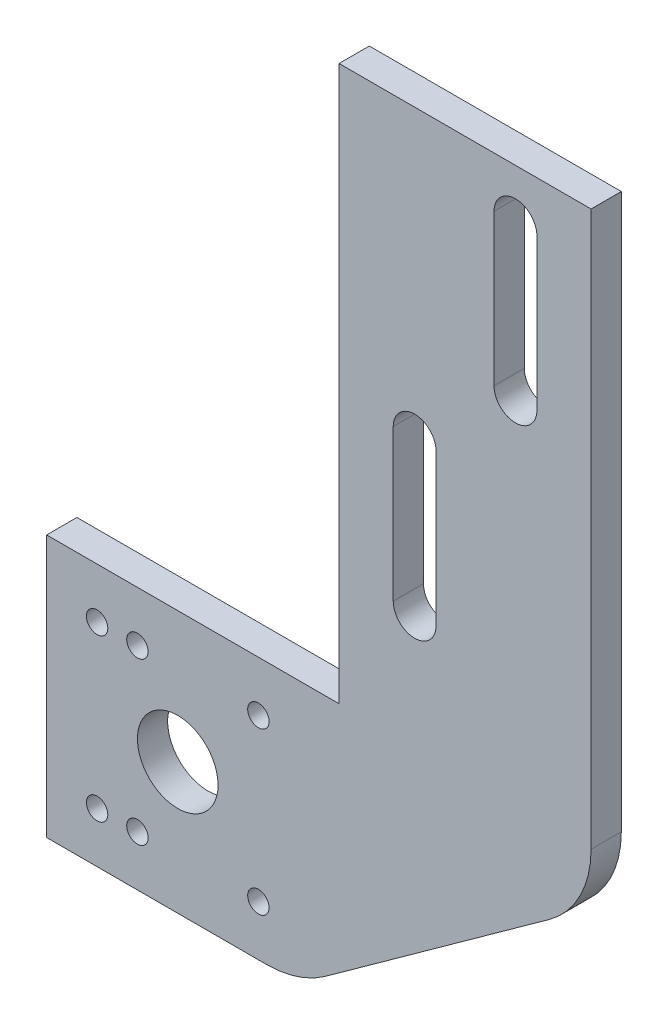
ISO-10303-21;
HEADER;
FILE_DESCRIPTION(('STEP AP214'),'2;1');
FILE_NAME('part.step','',(''),(''),'','','');
FILE_SCHEMA(('AUTOMOTIVE_DESIGN { 1 0 10303 214 1 1 1 1 }'));
ENDSEC;
DATA;
#1=APPLICATION_CONTEXT('core data for automotive mechanical design processes');
#2=APPLICATION_PROTOCOL_DEFINITION('international standard','automotive_design',2000,#1);
#3=PRODUCT_CONTEXT('',#1,'mechanical');
#4=PRODUCT('Part','Part','',(#3));
#5=PRODUCT_RELATED_PRODUCT_CATEGORY('part','',(#4));
#6=PRODUCT_DEFINITION_FORMATION('','',#4);
#7=PRODUCT_DEFINITION_CONTEXT('part definition',#1,'design');
#8=PRODUCT_DEFINITION('design','',#6,#7);
#9=PRODUCT_DEFINITION_SHAPE('','',#8);
#10=(LENGTH_UNIT() NAMED_UNIT(*) SI_UNIT(.MILLI.,.METRE.));
#11=(NAMED_UNIT(*) PLANE_ANGLE_UNIT() SI_UNIT($,.RADIAN.));
#12=(NAMED_UNIT(*) SI_UNIT($,.STERADIAN.) SOLID_ANGLE_UNIT());
#13=UNCERTAINTY_MEASURE_WITH_UNIT(LENGTH_MEASURE(1.E-05),#10,'distance_accuracy_value','');
#14=(GEOMETRIC_REPRESENTATION_CONTEXT(3) GLOBAL_UNCERTAINTY_ASSIGNED_CONTEXT((#13)) GLOBAL_UNIT_ASSIGNED_CONTEXT((#10,
#11,#12)) REPRESENTATION_CONTEXT('',''));
#15=CARTESIAN_POINT('',(0.,0.,0.));
#16=DIRECTION('',(0.,0.,1.));
#17=DIRECTION('',(1.,0.,0.));
#18=AXIS2_PLACEMENT_3D('',#15,#16,#17);
#19=CARTESIAN_POINT('',(65.6099737277178,39.5652331269895,6.));
#20=DIRECTION('',(0.,0.,-1.));
#21=DIRECTION('',(-1.,0.,0.));
#22=AXIS2_PLACEMENT_3D('',#19,#20,#21);
#23=PLANE('',#22);
#24=CARTESIAN_POINT('',(50.6099737277178,92.5652331269895,6.));
#25=DIRECTION('',(0.,0.,1.));
#26=DIRECTION('',(1.,0.,0.));
#27=AXIS2_PLACEMENT_3D('',#24,#25,#26);
#28=CIRCLE('',#27,4.24999999999999);
#29=CARTESIAN_POINT('',(54.8599737277178,92.5652331269895,6.));
#30=VERTEX_POINT('',#29);
#31=CARTESIAN_POINT('',(46.3599737277178,92.5652331269895,6.));
#32=VERTEX_POINT('',#31);
#33=EDGE_CURVE('E213',#30,#32,#28,.T.);
#34=ORIENTED_EDGE('',*,*,#33,.F.);
#35=DIRECTION('',(0.,1.,0.));
#36=VECTOR('',#35,1.);
#37=CARTESIAN_POINT('',(54.8599737277178,92.5652331269895,6.));
#38=LINE('',#37,#36);
#39=CARTESIAN_POINT('',(54.8599737277178,62.5652331269895,6.));
#40=VERTEX_POINT('',#39);
#41=EDGE_CURVE('E224',#40,#30,#38,.T.);
#42=ORIENTED_EDGE('',*,*,#41,.F.);
#43=CARTESIAN_POINT('',(50.6099737277178,62.5652331269895,6.));
#44=DIRECTION('',(0.,0.,1.));
#45=DIRECTION('',(1.,0.,0.));
#46=AXIS2_PLACEMENT_3D('',#43,#44,#45);
#47=CIRCLE('',#46,4.25);
#48=CARTESIAN_POINT('',(46.3599737277178,62.5652331269895,6.));
#49=VERTEX_POINT('',#48);
#50=EDGE_CURVE('E220',#49,#40,#47,.T.);
#51=ORIENTED_EDGE('',*,*,#50,.F.);
#52=DIRECTION('',(0.,-1.,0.));
#53=VECTOR('',#52,1.);
#54=CARTESIAN_POINT('',(46.3599737277178,92.5652331269895,6.));
#55=LINE('',#54,#53);
#56=EDGE_CURVE('E216',#32,#49,#55,.T.);
#57=ORIENTED_EDGE('',*,*,#56,.F.);
#58=EDGE_LOOP('',(#34,#42,#51,#57));
#59=FACE_BOUND('',#58,.T.);
#60=DIRECTION('',(0.,-1.,0.));
#61=VECTOR('',#60,1.);
#62=CARTESIAN_POINT('',(-22.3900262722822,-12.4347668730105,6.));
#63=LINE('',#62,#61);
#64=CARTESIAN_POINT('',(-22.3900262722822,39.5652331269895,6.));
#65=VERTEX_POINT('',#64);
#66=CARTESIAN_POINT('',(-22.3900262722822,-12.4347668730105,6.));
#67=VERTEX_POINT('',#66);
#68=EDGE_CURVE('E312',#65,#67,#63,.T.);
#69=ORIENTED_EDGE('',*,*,#68,.T.);
#70=DIRECTION('',(1.,0.,0.));
#71=VECTOR('',#70,1.);
#72=CARTESIAN_POINT('',(-22.3900262722822,-12.4347668730105,6.));
#73=LINE('',#72,#71);
#74=CARTESIAN_POINT('',(21.1597205443689,-12.4347668730105,6.));
#75=VERTEX_POINT('',#74);
#76=EDGE_CURVE('E316',#67,#75,#73,.T.);
#77=ORIENTED_EDGE('',*,*,#76,.T.);
#78=CARTESIAN_POINT('',(21.1597205443689,7.56523312698948,6.));
#79=DIRECTION('',(0.,0.,1.));
#80=DIRECTION('',(1.,0.,0.));
#81=AXIS2_PLACEMENT_3D('',#78,#79,#80);
#82=CIRCLE('',#81,20.);
#83=CARTESIAN_POINT('',(32.844809242165,-8.66617784447688,6.));
#84=VERTEX_POINT('',#83);
#85=EDGE_CURVE('E320',#75,#84,#82,.T.);
#86=ORIENTED_EDGE('',*,*,#85,.T.);
#87=DIRECTION('',(0.811570548573318,0.584254434889803,0.));
#88=VECTOR('',#87,1.);
#89=CARTESIAN_POINT('',(32.844809242165,-8.66617784447688,6.));
#90=LINE('',#89,#88);
#91=CARTESIAN_POINT('',(77.2950624255139,23.3338221555231,6.));
#92=VERTEX_POINT('',#91);
#93=EDGE_CURVE('E323',#84,#92,#90,.T.);
#94=ORIENTED_EDGE('',*,*,#93,.T.);
#95=CARTESIAN_POINT('',(65.6099737277178,39.5652331269895,6.));
#96=DIRECTION('',(0.,0.,1.));
#97=DIRECTION('',(-1.,0.,0.));
#98=AXIS2_PLACEMENT_3D('',#95,#96,#97);
#99=CIRCLE('',#98,20.);
#100=CARTESIAN_POINT('',(85.6099737277178,39.5652331269895,6.));
#101=VERTEX_POINT('',#100);
#102=EDGE_CURVE('E326',#92,#101,#99,.T.);
#103=ORIENTED_EDGE('',*,*,#102,.T.);
#104=DIRECTION('',(0.,1.,0.));
#105=VECTOR('',#104,1.);
#106=CARTESIAN_POINT('',(85.6099737277178,149.565233126989,6.));
#107=LINE('',#106,#105);
#108=CARTESIAN_POINT('',(85.6099737277178,149.565233126989,6.));
#109=VERTEX_POINT('',#108);
#110=EDGE_CURVE('E329',#101,#109,#107,.T.);
#111=ORIENTED_EDGE('',*,*,#110,.T.);
#112=DIRECTION('',(-1.,0.,0.));
#113=VECTOR('',#112,1.);
#114=CARTESIAN_POINT('',(35.6099737277178,149.565233126989,6.));
#115=LINE('',#114,#113);
#116=CARTESIAN_POINT('',(35.6099737277178,149.565233126989,6.));
#117=VERTEX_POINT('',#116);
#118=EDGE_CURVE('E332',#109,#117,#115,.T.);
#119=ORIENTED_EDGE('',*,*,#118,.T.);
#120=DIRECTION('',(0.,-1.,0.));
#121=VECTOR('',#120,1.);
#122=CARTESIAN_POINT('',(35.6099737277178,39.5652331269895,6.));
#123=LINE('',#122,#121);
#124=CARTESIAN_POINT('',(35.6099737277178,39.5652331269895,6.));
#125=VERTEX_POINT('',#124);
#126=EDGE_CURVE('E335',#117,#125,#123,.T.);
#127=ORIENTED_EDGE('',*,*,#126,.T.);
#128=DIRECTION('',(-1.,0.,0.));
#129=VECTOR('',#128,1.);
#130=CARTESIAN_POINT('',(27.6099737277178,39.5652331269895,6.));
#131=LINE('',#130,#129);
#132=EDGE_CURVE('E338',#125,#65,#131,.T.);
#133=ORIENTED_EDGE('',*,*,#132,.T.);
#134=EDGE_LOOP('',(#69,#77,#86,#94,#103,#111,#119,#127,#133));
#135=FACE_BOUND('',#134,.T.);
#136=CARTESIAN_POINT('',(-12.3900262722822,-2.43476687301052,6.));
#137=DIRECTION('',(0.,0.,1.));
#138=DIRECTION('',(1.,0.,0.));
#139=AXIS2_PLACEMENT_3D('',#136,#137,#138);
#140=CIRCLE('',#139,2.125);
#141=CARTESIAN_POINT('',(-10.2650262722822,-2.43476687301052,6.));
#142=VERTEX_POINT('',#141);
#143=EDGE_CURVE('E304',#142,#142,#140,.T.);
#144=ORIENTED_EDGE('',*,*,#143,.F.);
#145=EDGE_LOOP('',(#144));
#146=FACE_BOUND('',#145,.T.);
#147=CARTESIAN_POINT('',(-4.39002627228223,-2.43476687301052,6.));
#148=DIRECTION('',(0.,0.,1.));
#149=DIRECTION('',(1.,0.,0.));
#150=AXIS2_PLACEMENT_3D('',#147,#148,#149);
#151=CIRCLE('',#150,2.125);
#152=CARTESIAN_POINT('',(-2.26502627228223,-2.43476687301052,6.));
#153=VERTEX_POINT('',#152);
#154=EDGE_CURVE('E296',#153,#153,#151,.T.);
#155=ORIENTED_EDGE('',*,*,#154,.F.);
#156=EDGE_LOOP('',(#155));
#157=FACE_BOUND('',#156,.T.);
#158=CARTESIAN_POINT('',(19.6099737277178,-2.43476687301052,6.));
#159=DIRECTION('',(0.,0.,1.));
#160=DIRECTION('',(1.,0.,0.));
#161=AXIS2_PLACEMENT_3D('',#158,#159,#160);
#162=CIRCLE('',#161,2.125);
#163=CARTESIAN_POINT('',(21.7349737277178,-2.43476687301052,6.));
#164=VERTEX_POINT('',#163);
#165=EDGE_CURVE('E288',#164,#164,#162,.T.);
#166=ORIENTED_EDGE('',*,*,#165,.F.);
#167=EDGE_LOOP('',(#166));
#168=FACE_BOUND('',#167,.T.);
#169=CARTESIAN_POINT('',(-12.3900262722822,29.5652331269895,6.));
#170=DIRECTION('',(0.,0.,1.));
#171=DIRECTION('',(1.,0.,0.));
#172=AXIS2_PLACEMENT_3D('',#169,#170,#171);
#173=CIRCLE('',#172,2.125);
#174=CARTESIAN_POINT('',(-10.2650262722822,29.5652331269895,6.));
#175=VERTEX_POINT('',#174);
#176=EDGE_CURVE('E280',#175,#175,#173,.T.);
#177=ORIENTED_EDGE('',*,*,#176,.F.);
#178=EDGE_LOOP('',(#177));
#179=FACE_BOUND('',#178,.T.);
#180=CARTESIAN_POINT('',(-4.39002627228223,29.5652331269895,6.));
#181=DIRECTION('',(0.,0.,1.));
#182=DIRECTION('',(1.,0.,0.));
#183=AXIS2_PLACEMENT_3D('',#180,#181,#182);
#184=CIRCLE('',#183,2.125);
#185=CARTESIAN_POINT('',(-2.26502627228223,29.5652331269895,6.));
#186=VERTEX_POINT('',#185);
#187=EDGE_CURVE('E272',#186,#186,#184,.T.);
#188=ORIENTED_EDGE('',*,*,#187,.F.);
#189=EDGE_LOOP('',(#188));
#190=FACE_BOUND('',#189,.T.);
#191=CARTESIAN_POINT('',(19.6099737277178,29.5652331269895,6.));
#192=DIRECTION('',(0.,0.,1.));
#193=DIRECTION('',(1.,0.,0.));
#194=AXIS2_PLACEMENT_3D('',#191,#192,#193);
#195=CIRCLE('',#194,2.125);
#196=CARTESIAN_POINT('',(21.7349737277178,29.5652331269895,6.));
#197=VERTEX_POINT('',#196);
#198=EDGE_CURVE('E264',#197,#197,#195,.T.);
#199=ORIENTED_EDGE('',*,*,#198,.F.);
#200=EDGE_LOOP('',(#199));
#201=FACE_BOUND('',#200,.T.);
#202=CARTESIAN_POINT('',(3.60997372771777,13.5652331269895,6.));
#203=DIRECTION('',(0.,0.,1.));
#204=DIRECTION('',(1.,0.,0.));
#205=AXIS2_PLACEMENT_3D('',#202,#203,#204);
#206=CIRCLE('',#205,8.00000000000001);
#207=CARTESIAN_POINT('',(11.6099737277178,13.5652331269895,6.));
#208=VERTEX_POINT('',#207);
#209=EDGE_CURVE('E256',#208,#208,#206,.T.);
#210=ORIENTED_EDGE('',*,*,#209,.F.);
#211=EDGE_LOOP('',(#210));
#212=FACE_BOUND('',#211,.T.);
#213=CARTESIAN_POINT('',(70.6099737277178,109.565233126989,6.));
#214=DIRECTION('',(0.,0.,1.));
#215=DIRECTION('',(1.,0.,0.));
#216=AXIS2_PLACEMENT_3D('',#213,#214,#215);
#217=CIRCLE('',#216,4.25);
#218=CARTESIAN_POINT('',(66.3599737277178,109.565233126989,6.));
#219=VERTEX_POINT('',#218);
#220=CARTESIAN_POINT('',(74.8599737277178,109.565233126989,6.));
#221=VERTEX_POINT('',#220);
#222=EDGE_CURVE('E165',#219,#221,#217,.T.);
#223=ORIENTED_EDGE('',*,*,#222,.F.);
#224=DIRECTION('',(0.,-1.,0.));
#225=VECTOR('',#224,1.);
#226=CARTESIAN_POINT('',(66.3599737277178,109.565233126989,6.));
#227=LINE('',#226,#225);
#228=CARTESIAN_POINT('',(66.3599737277178,139.565233126989,6.));
#229=VERTEX_POINT('',#228);
#230=EDGE_CURVE('E191',#229,#219,#227,.T.);
#231=ORIENTED_EDGE('',*,*,#230,.F.);
#232=CARTESIAN_POINT('',(70.6099737277178,139.565233126989,6.));
#233=DIRECTION('',(0.,0.,1.));
#234=DIRECTION('',(1.,0.,0.));
#235=AXIS2_PLACEMENT_3D('',#232,#233,#234);
#236=CIRCLE('',#235,4.25);
#237=CARTESIAN_POINT('',(74.8599737277178,139.565233126989,6.));
#238=VERTEX_POINT('',#237);
#239=EDGE_CURVE('E187',#238,#229,#236,.T.);
#240=ORIENTED_EDGE('',*,*,#239,.F.);
#241=DIRECTION('',(0.,1.,0.));
#242=VECTOR('',#241,1.);
#243=CARTESIAN_POINT('',(74.8599737277178,109.565233126989,6.));
#244=LINE('',#243,#242);
#245=EDGE_CURVE('E174',#221,#238,#244,.T.);
#246=ORIENTED_EDGE('',*,*,#245,.F.);
#247=EDGE_LOOP('',(#223,#231,#240,#246));
#248=FACE_BOUND('',#247,.T.);
#249=ADVANCED_FACE('F45',(#59,#135,#146,#157,#168,#179,#190,#201,#212,#248),#23,.F.);
#250=CARTESIAN_POINT('',(65.6099737277178,39.5652331269895,0.));
#251=DIRECTION('',(0.,0.,-1.));
#252=DIRECTION('',(-1.,0.,0.));
#253=AXIS2_PLACEMENT_3D('',#250,#251,#252);
#254=PLANE('',#253);
#255=CARTESIAN_POINT('',(19.6099737277178,29.5652331269895,0.));
#256=DIRECTION('',(0.,0.,1.));
#257=DIRECTION('',(1.,0.,0.));
#258=AXIS2_PLACEMENT_3D('',#255,#256,#257);
#259=CIRCLE('',#258,2.125);
#260=CARTESIAN_POINT('',(21.7349737277178,29.5652331269895,0.));
#261=VERTEX_POINT('',#260);
#262=EDGE_CURVE('E260',#261,#261,#259,.T.);
#263=ORIENTED_EDGE('',*,*,#262,.T.);
#264=EDGE_LOOP('',(#263));
#265=FACE_BOUND('',#264,.T.);
#266=CARTESIAN_POINT('',(-12.3900262722822,29.5652331269895,0.));
#267=DIRECTION('',(0.,0.,1.));
#268=DIRECTION('',(1.,0.,0.));
#269=AXIS2_PLACEMENT_3D('',#266,#267,#268);
#270=CIRCLE('',#269,2.125);
#271=CARTESIAN_POINT('',(-10.2650262722822,29.5652331269895,0.));
#272=VERTEX_POINT('',#271);
#273=EDGE_CURVE('E276',#272,#272,#270,.T.);
#274=ORIENTED_EDGE('',*,*,#273,.T.);
#275=EDGE_LOOP('',(#274));
#276=FACE_BOUND('',#275,.T.);
#277=CARTESIAN_POINT('',(-4.39002627228223,-2.43476687301052,0.));
#278=DIRECTION('',(0.,0.,1.));
#279=DIRECTION('',(1.,0.,0.));
#280=AXIS2_PLACEMENT_3D('',#277,#278,#279);
#281=CIRCLE('',#280,2.125);
#282=CARTESIAN_POINT('',(-2.26502627228223,-2.43476687301052,0.));
#283=VERTEX_POINT('',#282);
#284=EDGE_CURVE('E292',#283,#283,#281,.T.);
#285=ORIENTED_EDGE('',*,*,#284,.T.);
#286=EDGE_LOOP('',(#285));
#287=FACE_BOUND('',#286,.T.);
#288=DIRECTION('',(0.,-1.,0.));
#289=VECTOR('',#288,1.);
#290=CARTESIAN_POINT('',(-22.3900262722822,-12.4347668730105,0.));
#291=LINE('',#290,#289);
#292=CARTESIAN_POINT('',(-22.3900262722822,39.5652331269895,0.));
#293=VERTEX_POINT('',#292);
#294=CARTESIAN_POINT('',(-22.3900262722822,-12.4347668730105,0.));
#295=VERTEX_POINT('',#294);
#296=EDGE_CURVE('E308',#293,#295,#291,.T.);
#297=ORIENTED_EDGE('',*,*,#296,.F.);
#298=DIRECTION('',(-1.,0.,0.));
#299=VECTOR('',#298,1.);
#300=CARTESIAN_POINT('',(-22.3900262722822,39.5652331269895,0.));
#301=LINE('',#300,#299);
#302=CARTESIAN_POINT('',(35.6099737277178,39.5652331269895,0.));
#303=VERTEX_POINT('',#302);
#304=EDGE_CURVE('E317',#303,#293,#301,.T.);
#305=ORIENTED_EDGE('',*,*,#304,.F.);
#306=DIRECTION('',(0.,-1.,0.));
#307=VECTOR('',#306,1.);
#308=CARTESIAN_POINT('',(35.6099737277178,39.5652331269895,0.));
#309=LINE('',#308,#307);
#310=CARTESIAN_POINT('',(35.6099737277178,149.565233126989,0.));
#311=VERTEX_POINT('',#310);
#312=EDGE_CURVE('E363',#311,#303,#309,.T.);
#313=ORIENTED_EDGE('',*,*,#312,.F.);
#314=DIRECTION('',(-1.,0.,0.));
#315=VECTOR('',#314,1.);
#316=CARTESIAN_POINT('',(35.6099737277178,149.565233126989,0.));
#317=LINE('',#316,#315);
#318=CARTESIAN_POINT('',(85.6099737277178,149.565233126989,0.));
#319=VERTEX_POINT('',#318);
#320=EDGE_CURVE('E360',#319,#311,#317,.T.);
#321=ORIENTED_EDGE('',*,*,#320,.F.);
#322=DIRECTION('',(0.,1.,0.));
#323=VECTOR('',#322,1.);
#324=CARTESIAN_POINT('',(85.6099737277178,149.565233126989,0.));
#325=LINE('',#324,#323);
#326=CARTESIAN_POINT('',(85.6099737277178,39.5652331269895,0.));
#327=VERTEX_POINT('',#326);
#328=EDGE_CURVE('E357',#327,#319,#325,.T.);
#329=ORIENTED_EDGE('',*,*,#328,.F.);
#330=CARTESIAN_POINT('',(65.6099737277178,39.5652331269895,0.));
#331=DIRECTION('',(0.,0.,1.));
#332=DIRECTION('',(-1.,0.,0.));
#333=AXIS2_PLACEMENT_3D('',#330,#331,#332);
#334=CIRCLE('',#333,20.);
#335=CARTESIAN_POINT('',(77.2950624255139,23.3338221555231,0.));
#336=VERTEX_POINT('',#335);
#337=EDGE_CURVE('E354',#336,#327,#334,.T.);
#338=ORIENTED_EDGE('',*,*,#337,.F.);
#339=DIRECTION('',(0.811570548573318,0.584254434889803,0.));
#340=VECTOR('',#339,1.);
#341=CARTESIAN_POINT('',(32.844809242165,-8.66617784447688,0.));
#342=LINE('',#341,#340);
#343=CARTESIAN_POINT('',(32.844809242165,-8.66617784447688,0.));
#344=VERTEX_POINT('',#343);
#345=EDGE_CURVE('E351',#344,#336,#342,.T.);
#346=ORIENTED_EDGE('',*,*,#345,.F.);
#347=CARTESIAN_POINT('',(21.1597205443689,7.56523312698948,0.));
#348=DIRECTION('',(0.,0.,1.));
#349=DIRECTION('',(1.,0.,0.));
#350=AXIS2_PLACEMENT_3D('',#347,#348,#349);
#351=CIRCLE('',#350,20.);
#352=CARTESIAN_POINT('',(21.1597205443689,-12.4347668730105,0.));
#353=VERTEX_POINT('',#352);
#354=EDGE_CURVE('E348',#353,#344,#351,.T.);
#355=ORIENTED_EDGE('',*,*,#354,.F.);
#356=DIRECTION('',(1.,0.,0.));
#357=VECTOR('',#356,1.);
#358=CARTESIAN_POINT('',(-22.3900262722822,-12.4347668730105,0.));
#359=LINE('',#358,#357);
#360=EDGE_CURVE('E345',#295,#353,#359,.T.);
#361=ORIENTED_EDGE('',*,*,#360,.F.);
#362=EDGE_LOOP('',(#297,#305,#313,#321,#329,#338,#346,#355,#361));
#363=FACE_BOUND('',#362,.T.);
#364=CARTESIAN_POINT('',(-12.3900262722822,-2.43476687301052,0.));
#365=DIRECTION('',(0.,0.,1.));
#366=DIRECTION('',(1.,0.,0.));
#367=AXIS2_PLACEMENT_3D('',#364,#365,#366);
#368=CIRCLE('',#367,2.125);
#369=CARTESIAN_POINT('',(-10.2650262722822,-2.43476687301052,0.));
#370=VERTEX_POINT('',#369);
#371=EDGE_CURVE('E300',#370,#370,#368,.T.);
#372=ORIENTED_EDGE('',*,*,#371,.T.);
#373=EDGE_LOOP('',(#372));
#374=FACE_BOUND('',#373,.T.);
#375=CARTESIAN_POINT('',(19.6099737277178,-2.43476687301052,0.));
#376=DIRECTION('',(0.,0.,1.));
#377=DIRECTION('',(1.,0.,0.));
#378=AXIS2_PLACEMENT_3D('',#375,#376,#377);
#379=CIRCLE('',#378,2.125);
#380=CARTESIAN_POINT('',(21.7349737277178,-2.43476687301052,0.));
#381=VERTEX_POINT('',#380);
#382=EDGE_CURVE('E284',#381,#381,#379,.T.);
#383=ORIENTED_EDGE('',*,*,#382,.T.);
#384=EDGE_LOOP('',(#383));
#385=FACE_BOUND('',#384,.T.);
#386=CARTESIAN_POINT('',(-4.39002627228223,29.5652331269895,0.));
#387=DIRECTION('',(0.,0.,1.));
#388=DIRECTION('',(1.,0.,0.));
#389=AXIS2_PLACEMENT_3D('',#386,#387,#388);
#390=CIRCLE('',#389,2.125);
#391=CARTESIAN_POINT('',(-2.26502627228223,29.5652331269895,0.));
#392=VERTEX_POINT('',#391);
#393=EDGE_CURVE('E268',#392,#392,#390,.T.);
#394=ORIENTED_EDGE('',*,*,#393,.T.);
#395=EDGE_LOOP('',(#394));
#396=FACE_BOUND('',#395,.T.);
#397=CARTESIAN_POINT('',(3.60997372771777,13.5652331269895,0.));
#398=DIRECTION('',(0.,0.,1.));
#399=DIRECTION('',(1.,0.,0.));
#400=AXIS2_PLACEMENT_3D('',#397,#398,#399);
#401=CIRCLE('',#400,8.00000000000001);
#402=CARTESIAN_POINT('',(11.6099737277178,13.5652331269895,0.));
#403=VERTEX_POINT('',#402);
#404=EDGE_CURVE('E255',#403,#403,#401,.T.);
#405=ORIENTED_EDGE('',*,*,#404,.T.);
#406=EDGE_LOOP('',(#405));
#407=FACE_BOUND('',#406,.T.);
#408=DIRECTION('',(0.,1.,0.));
#409=VECTOR('',#408,1.);
#410=CARTESIAN_POINT('',(54.8599737277178,92.5652331269895,0.));
#411=LINE('',#410,#409);
#412=CARTESIAN_POINT('',(54.8599737277178,62.5652331269895,0.));
#413=VERTEX_POINT('',#412);
#414=CARTESIAN_POINT('',(54.8599737277178,92.5652331269895,0.));
#415=VERTEX_POINT('',#414);
#416=EDGE_CURVE('E217',#413,#415,#411,.T.);
#417=ORIENTED_EDGE('',*,*,#416,.T.);
#418=CARTESIAN_POINT('',(50.6099737277178,92.5652331269895,0.));
#419=DIRECTION('',(0.,0.,1.));
#420=DIRECTION('',(1.,0.,0.));
#421=AXIS2_PLACEMENT_3D('',#418,#419,#420);
#422=CIRCLE('',#421,4.24999999999999);
#423=CARTESIAN_POINT('',(46.3599737277178,92.5652331269895,0.));
#424=VERTEX_POINT('',#423);
#425=EDGE_CURVE('E183',#415,#424,#422,.T.);
#426=ORIENTED_EDGE('',*,*,#425,.T.);
#427=DIRECTION('',(0.,-1.,0.));
#428=VECTOR('',#427,1.);
#429=CARTESIAN_POINT('',(46.3599737277178,92.5652331269895,0.));
#430=LINE('',#429,#428);
#431=CARTESIAN_POINT('',(46.3599737277178,62.5652331269895,0.));
#432=VERTEX_POINT('',#431);
#433=EDGE_CURVE('E231',#424,#432,#430,.T.);
#434=ORIENTED_EDGE('',*,*,#433,.T.);
#435=CARTESIAN_POINT('',(50.6099737277178,62.5652331269895,0.));
#436=DIRECTION('',(0.,0.,1.));
#437=DIRECTION('',(1.,0.,0.));
#438=AXIS2_PLACEMENT_3D('',#435,#436,#437);
#439=CIRCLE('',#438,4.25);
#440=EDGE_CURVE('E235',#432,#413,#439,.T.);
#441=ORIENTED_EDGE('',*,*,#440,.T.);
#442=EDGE_LOOP('',(#417,#426,#434,#441));
#443=FACE_BOUND('',#442,.T.);
#444=DIRECTION('',(0.,-1.,0.));
#445=VECTOR('',#444,1.);
#446=CARTESIAN_POINT('',(66.3599737277178,109.565233126989,0.));
#447=LINE('',#446,#445);
#448=CARTESIAN_POINT('',(66.3599737277178,139.565233126989,0.));
#449=VERTEX_POINT('',#448);
#450=CARTESIAN_POINT('',(66.3599737277178,109.565233126989,0.));
#451=VERTEX_POINT('',#450);
#452=EDGE_CURVE('E175',#449,#451,#447,.T.);
#453=ORIENTED_EDGE('',*,*,#452,.T.);
#454=CARTESIAN_POINT('',(70.6099737277178,109.565233126989,0.));
#455=DIRECTION('',(0.,0.,1.));
#456=DIRECTION('',(1.,0.,0.));
#457=AXIS2_PLACEMENT_3D('',#454,#455,#456);
#458=CIRCLE('',#457,4.25);
#459=CARTESIAN_POINT('',(74.8599737277178,109.565233126989,0.));
#460=VERTEX_POINT('',#459);
#461=EDGE_CURVE('E69',#451,#460,#458,.T.);
#462=ORIENTED_EDGE('',*,*,#461,.T.);
#463=DIRECTION('',(0.,1.,0.));
#464=VECTOR('',#463,1.);
#465=CARTESIAN_POINT('',(74.8599737277178,109.565233126989,0.));
#466=LINE('',#465,#464);
#467=CARTESIAN_POINT('',(74.8599737277178,139.565233126989,0.));
#468=VERTEX_POINT('',#467);
#469=EDGE_CURVE('E181',#460,#468,#466,.T.);
#470=ORIENTED_EDGE('',*,*,#469,.T.);
#471=CARTESIAN_POINT('',(70.6099737277178,139.565233126989,0.));
#472=DIRECTION('',(0.,0.,1.));
#473=DIRECTION('',(1.,0.,0.));
#474=AXIS2_PLACEMENT_3D('',#471,#472,#473);
#475=CIRCLE('',#474,4.25);
#476=EDGE_CURVE('E200',#468,#449,#475,.T.);
#477=ORIENTED_EDGE('',*,*,#476,.T.);
#478=EDGE_LOOP('',(#453,#462,#470,#477));
#479=FACE_BOUND('',#478,.T.);
#480=ADVANCED_FACE('F407',(#265,#276,#287,#363,#374,#385,#396,#407,#443,#479),#254,.T.);
#481=CARTESIAN_POINT('',(-22.3900262722822,-12.4347668730105,6.));
#482=DIRECTION('',(1.,0.,0.));
#483=DIRECTION('',(0.,0.,-1.));
#484=AXIS2_PLACEMENT_3D('',#481,#482,#483);
#485=PLANE('',#484);
#486=ORIENTED_EDGE('',*,*,#296,.T.);
#487=DIRECTION('',(0.,0.,-1.));
#488=VECTOR('',#487,1.);
#489=CARTESIAN_POINT('',(-22.3900262722822,-12.4347668730105,6.));
#490=LINE('',#489,#488);
#491=EDGE_CURVE('E11',#67,#295,#490,.T.);
#492=ORIENTED_EDGE('',*,*,#491,.F.);
#493=ORIENTED_EDGE('',*,*,#68,.F.);
#494=DIRECTION('',(0.,0.,-1.));
#495=VECTOR('',#494,1.);
#496=CARTESIAN_POINT('',(-22.3900262722822,39.5652331269895,6.));
#497=LINE('',#496,#495);
#498=EDGE_CURVE('E341',#65,#293,#497,.T.);
#499=ORIENTED_EDGE('',*,*,#498,.T.);
#500=EDGE_LOOP('',(#486,#492,#493,#499));
#501=FACE_BOUND('',#500,.T.);
#502=ADVANCED_FACE('F47',(#501),#485,.F.);
#503=CARTESIAN_POINT('',(-22.3900262722822,-12.4347668730105,6.));
#504=DIRECTION('',(0.,1.,0.));
#505=DIRECTION('',(-1.,0.,0.));
#506=AXIS2_PLACEMENT_3D('',#503,#504,#505);
#507=PLANE('',#506);
#508=ORIENTED_EDGE('',*,*,#360,.T.);
#509=DIRECTION('',(0.,0.,-1.));
#510=VECTOR('',#509,1.);
#511=CARTESIAN_POINT('',(21.1597205443689,-12.4347668730105,6.));
#512=LINE('',#511,#510);
#513=EDGE_CURVE('E54',#75,#353,#512,.T.);
#514=ORIENTED_EDGE('',*,*,#513,.F.);
#515=ORIENTED_EDGE('',*,*,#76,.F.);
#516=ORIENTED_EDGE('',*,*,#491,.T.);
#517=EDGE_LOOP('',(#508,#514,#515,#516));
#518=FACE_BOUND('',#517,.T.);
#519=ADVANCED_FACE('F425',(#518),#507,.F.);
#520=CARTESIAN_POINT('',(21.1597205443689,7.56523312698948,6.));
#521=DIRECTION('',(0.,0.,-1.));
#522=DIRECTION('',(-1.,0.,0.));
#523=AXIS2_PLACEMENT_3D('',#520,#521,#522);
#524=CYLINDRICAL_SURFACE('',#523,20.);
#525=ORIENTED_EDGE('',*,*,#354,.T.);
#526=DIRECTION('',(0.,0.,-1.));
#527=VECTOR('',#526,1.);
#528=CARTESIAN_POINT('',(32.844809242165,-8.66617784447688,6.));
#529=LINE('',#528,#527);
#530=EDGE_CURVE('E392',#84,#344,#529,.T.);
#531=ORIENTED_EDGE('',*,*,#530,.F.);
#532=ORIENTED_EDGE('',*,*,#85,.F.);
#533=ORIENTED_EDGE('',*,*,#513,.T.);
#534=EDGE_LOOP('',(#525,#531,#532,#533));
#535=FACE_BOUND('',#534,.T.);
#536=ADVANCED_FACE('F401',(#535),#524,.T.);
#537=CARTESIAN_POINT('',(32.844809242165,-8.66617784447688,6.));
#538=DIRECTION('',(-0.584254434889803,0.811570548573318,0.));
#539=DIRECTION('',(-0.811570548573318,-0.584254434889803,0.));
#540=AXIS2_PLACEMENT_3D('',#537,#538,#539);
#541=PLANE('',#540);
#542=ORIENTED_EDGE('',*,*,#345,.T.);
#543=DIRECTION('',(0.,0.,-1.));
#544=VECTOR('',#543,1.);
#545=CARTESIAN_POINT('',(77.2950624255139,23.3338221555231,6.));
#546=LINE('',#545,#544);
#547=EDGE_CURVE('E388',#92,#336,#546,.T.);
#548=ORIENTED_EDGE('',*,*,#547,.F.);
#549=ORIENTED_EDGE('',*,*,#93,.F.);
#550=ORIENTED_EDGE('',*,*,#530,.T.);
#551=EDGE_LOOP('',(#542,#548,#549,#550));
#552=FACE_BOUND('',#551,.T.);
#553=ADVANCED_FACE('F413',(#552),#541,.F.);
#554=CARTESIAN_POINT('',(65.6099737277178,39.5652331269895,6.));
#555=DIRECTION('',(0.,0.,-1.));
#556=DIRECTION('',(-1.,0.,0.));
#557=AXIS2_PLACEMENT_3D('',#554,#555,#556);
#558=CYLINDRICAL_SURFACE('',#557,20.);
#559=ORIENTED_EDGE('',*,*,#337,.T.);
#560=DIRECTION('',(0.,0.,-1.));
#561=VECTOR('',#560,1.);
#562=CARTESIAN_POINT('',(85.6099737277178,39.5652331269895,6.));
#563=LINE('',#562,#561);
#564=EDGE_CURVE('E384',#101,#327,#563,.T.);
#565=ORIENTED_EDGE('',*,*,#564,.F.);
#566=ORIENTED_EDGE('',*,*,#102,.F.);
#567=ORIENTED_EDGE('',*,*,#547,.T.);
#568=EDGE_LOOP('',(#559,#565,#566,#567));
#569=FACE_BOUND('',#568,.T.);
#570=ADVANCED_FACE('F417',(#569),#558,.T.);
#571=CARTESIAN_POINT('',(85.6099737277178,149.565233126989,6.));
#572=DIRECTION('',(-1.,0.,0.));
#573=DIRECTION('',(0.,-1.,0.));
#574=AXIS2_PLACEMENT_3D('',#571,#572,#573);
#575=PLANE('',#574);
#576=ORIENTED_EDGE('',*,*,#328,.T.);
#577=DIRECTION('',(0.,0.,-1.));
#578=VECTOR('',#577,1.);
#579=CARTESIAN_POINT('',(85.6099737277178,149.565233126989,6.));
#580=LINE('',#579,#578);
#581=EDGE_CURVE('E380',#109,#319,#580,.T.);
#582=ORIENTED_EDGE('',*,*,#581,.F.);
#583=ORIENTED_EDGE('',*,*,#110,.F.);
#584=ORIENTED_EDGE('',*,*,#564,.T.);
#585=EDGE_LOOP('',(#576,#582,#583,#584));
#586=FACE_BOUND('',#585,.T.);
#587=ADVANCED_FACE('F442',(#586),#575,.F.);
#588=CARTESIAN_POINT('',(35.6099737277178,149.565233126989,6.));
#589=DIRECTION('',(0.,-1.,0.));
#590=DIRECTION('',(0.,0.,-1.));
#591=AXIS2_PLACEMENT_3D('',#588,#589,#590);
#592=PLANE('',#591);
#593=ORIENTED_EDGE('',*,*,#320,.T.);
#594=DIRECTION('',(0.,0.,-1.));
#595=VECTOR('',#594,1.);
#596=CARTESIAN_POINT('',(35.6099737277178,149.565233126989,6.));
#597=LINE('',#596,#595);
#598=EDGE_CURVE('E376',#117,#311,#597,.T.);
#599=ORIENTED_EDGE('',*,*,#598,.F.);
#600=ORIENTED_EDGE('',*,*,#118,.F.);
#601=ORIENTED_EDGE('',*,*,#581,.T.);
#602=EDGE_LOOP('',(#593,#599,#600,#601));
#603=FACE_BOUND('',#602,.T.);
#604=ADVANCED_FACE('F440',(#603),#592,.F.);
#605=CARTESIAN_POINT('',(35.6099737277178,39.5652331269895,6.));
#606=DIRECTION('',(1.,0.,0.));
#607=DIRECTION('',(0.,0.,-1.));
#608=AXIS2_PLACEMENT_3D('',#605,#606,#607);
#609=PLANE('',#608);
#610=ORIENTED_EDGE('',*,*,#312,.T.);
#611=DIRECTION('',(0.,0.,-1.));
#612=VECTOR('',#611,1.);
#613=CARTESIAN_POINT('',(35.6099737277178,39.5652331269895,6.));
#614=LINE('',#613,#612);
#615=EDGE_CURVE('E372',#125,#303,#614,.T.);
#616=ORIENTED_EDGE('',*,*,#615,.F.);
#617=ORIENTED_EDGE('',*,*,#126,.F.);
#618=ORIENTED_EDGE('',*,*,#598,.T.);
#619=EDGE_LOOP('',(#610,#616,#617,#618));
#620=FACE_BOUND('',#619,.T.);
#621=ADVANCED_FACE('F433',(#620),#609,.F.);
#622=CARTESIAN_POINT('',(-22.3900262722822,39.5652331269895,6.));
#623=DIRECTION('',(0.,-1.,0.));
#624=DIRECTION('',(0.,0.,-1.));
#625=AXIS2_PLACEMENT_3D('',#622,#623,#624);
#626=PLANE('',#625);
#627=ORIENTED_EDGE('',*,*,#304,.T.);
#628=ORIENTED_EDGE('',*,*,#498,.F.);
#629=ORIENTED_EDGE('',*,*,#132,.F.);
#630=ORIENTED_EDGE('',*,*,#615,.T.);
#631=EDGE_LOOP('',(#627,#628,#629,#630));
#632=FACE_BOUND('',#631,.T.);
#633=ADVANCED_FACE('F437',(#632),#626,.F.);
#634=CARTESIAN_POINT('',(-12.3900262722822,-2.43476687301052,6.));
#635=DIRECTION('',(0.,0.,-1.));
#636=DIRECTION('',(-1.,0.,0.));
#637=AXIS2_PLACEMENT_3D('',#634,#635,#636);
#638=CYLINDRICAL_SURFACE('',#637,2.125);
#639=ORIENTED_EDGE('',*,*,#143,.T.);
#640=EDGE_LOOP('',(#639));
#641=FACE_BOUND('',#640,.T.);
#642=ORIENTED_EDGE('',*,*,#371,.F.);
#643=EDGE_LOOP('',(#642));
#644=FACE_BOUND('',#643,.T.);
#645=ADVANCED_FACE('F461',(#641,#644),#638,.F.);
#646=CARTESIAN_POINT('',(-4.39002627228223,-2.43476687301052,6.));
#647=DIRECTION('',(0.,0.,-1.));
#648=DIRECTION('',(-1.,0.,0.));
#649=AXIS2_PLACEMENT_3D('',#646,#647,#648);
#650=CYLINDRICAL_SURFACE('',#649,2.125);
#651=ORIENTED_EDGE('',*,*,#154,.T.);
#652=EDGE_LOOP('',(#651));
#653=FACE_BOUND('',#652,.T.);
#654=ORIENTED_EDGE('',*,*,#284,.F.);
#655=EDGE_LOOP('',(#654));
#656=FACE_BOUND('',#655,.T.);
#657=ADVANCED_FACE('F483',(#653,#656),#650,.F.);
#658=CARTESIAN_POINT('',(19.6099737277178,-2.43476687301052,6.));
#659=DIRECTION('',(0.,0.,-1.));
#660=DIRECTION('',(-1.,0.,0.));
#661=AXIS2_PLACEMENT_3D('',#658,#659,#660);
#662=CYLINDRICAL_SURFACE('',#661,2.125);
#663=ORIENTED_EDGE('',*,*,#165,.T.);
#664=EDGE_LOOP('',(#663));
#665=FACE_BOUND('',#664,.T.);
#666=ORIENTED_EDGE('',*,*,#382,.F.);
#667=EDGE_LOOP('',(#666));
#668=FACE_BOUND('',#667,.T.);
#669=ADVANCED_FACE('F491',(#665,#668),#662,.F.);
#670=CARTESIAN_POINT('',(-12.3900262722822,29.5652331269895,6.));
#671=DIRECTION('',(0.,0.,-1.));
#672=DIRECTION('',(-1.,0.,0.));
#673=AXIS2_PLACEMENT_3D('',#670,#671,#672);
#674=CYLINDRICAL_SURFACE('',#673,2.125);
#675=ORIENTED_EDGE('',*,*,#176,.T.);
#676=EDGE_LOOP('',(#675));
#677=FACE_BOUND('',#676,.T.);
#678=ORIENTED_EDGE('',*,*,#273,.F.);
#679=EDGE_LOOP('',(#678));
#680=FACE_BOUND('',#679,.T.);
#681=ADVANCED_FACE('F499',(#677,#680),#674,.F.);
#682=CARTESIAN_POINT('',(-4.39002627228223,29.5652331269895,6.));
#683=DIRECTION('',(0.,0.,-1.));
#684=DIRECTION('',(-1.,0.,0.));
#685=AXIS2_PLACEMENT_3D('',#682,#683,#684);
#686=CYLINDRICAL_SURFACE('',#685,2.125);
#687=ORIENTED_EDGE('',*,*,#187,.T.);
#688=EDGE_LOOP('',(#687));
#689=FACE_BOUND('',#688,.T.);
#690=ORIENTED_EDGE('',*,*,#393,.F.);
#691=EDGE_LOOP('',(#690));
#692=FACE_BOUND('',#691,.T.);
#693=ADVANCED_FACE('F508',(#689,#692),#686,.F.);
#694=CARTESIAN_POINT('',(19.6099737277178,29.5652331269895,6.));
#695=DIRECTION('',(0.,0.,-1.));
#696=DIRECTION('',(-1.,0.,0.));
#697=AXIS2_PLACEMENT_3D('',#694,#695,#696);
#698=CYLINDRICAL_SURFACE('',#697,2.125);
#699=ORIENTED_EDGE('',*,*,#198,.T.);
#700=EDGE_LOOP('',(#699));
#701=FACE_BOUND('',#700,.T.);
#702=ORIENTED_EDGE('',*,*,#262,.F.);
#703=EDGE_LOOP('',(#702));
#704=FACE_BOUND('',#703,.T.);
#705=ADVANCED_FACE('F517',(#701,#704),#698,.F.);
#706=CARTESIAN_POINT('',(3.60997372771777,13.5652331269895,6.));
#707=DIRECTION('',(0.,0.,-1.));
#708=DIRECTION('',(-1.,0.,0.));
#709=AXIS2_PLACEMENT_3D('',#706,#707,#708);
#710=CYLINDRICAL_SURFACE('',#709,8.00000000000001);
#711=ORIENTED_EDGE('',*,*,#209,.T.);
#712=EDGE_LOOP('',(#711));
#713=FACE_BOUND('',#712,.T.);
#714=ORIENTED_EDGE('',*,*,#404,.F.);
#715=EDGE_LOOP('',(#714));
#716=FACE_BOUND('',#715,.T.);
#717=ADVANCED_FACE('F526',(#713,#716),#710,.F.);
#718=CARTESIAN_POINT('',(50.6099737277178,92.5652331269895,6.));
#719=DIRECTION('',(0.,0.,-1.));
#720=DIRECTION('',(-1.,0.,0.));
#721=AXIS2_PLACEMENT_3D('',#718,#719,#720);
#722=CYLINDRICAL_SURFACE('',#721,4.24999999999999);
#723=ORIENTED_EDGE('',*,*,#425,.F.);
#724=DIRECTION('',(0.,0.,-1.));
#725=VECTOR('',#724,1.);
#726=CARTESIAN_POINT('',(54.8599737277178,92.5652331269895,6.));
#727=LINE('',#726,#725);
#728=EDGE_CURVE('E227',#30,#415,#727,.T.);
#729=ORIENTED_EDGE('',*,*,#728,.F.);
#730=ORIENTED_EDGE('',*,*,#33,.T.);
#731=DIRECTION('',(0.,0.,-1.));
#732=VECTOR('',#731,1.);
#733=CARTESIAN_POINT('',(46.3599737277178,92.5652331269895,6.));
#734=LINE('',#733,#732);
#735=EDGE_CURVE('E251',#32,#424,#734,.T.);
#736=ORIENTED_EDGE('',*,*,#735,.T.);
#737=EDGE_LOOP('',(#723,#729,#730,#736));
#738=FACE_BOUND('',#737,.T.);
#739=ADVANCED_FACE('F535',(#738),#722,.F.);
#740=CARTESIAN_POINT('',(46.3599737277178,92.5652331269895,6.));
#741=DIRECTION('',(1.,0.,0.));
#742=DIRECTION('',(0.,1.,0.));
#743=AXIS2_PLACEMENT_3D('',#740,#741,#742);
#744=PLANE('',#743);
#745=ORIENTED_EDGE('',*,*,#433,.F.);
#746=ORIENTED_EDGE('',*,*,#735,.F.);
#747=ORIENTED_EDGE('',*,*,#56,.T.);
#748=DIRECTION('',(0.,0.,-1.));
#749=VECTOR('',#748,1.);
#750=CARTESIAN_POINT('',(46.3599737277178,62.5652331269895,6.));
#751=LINE('',#750,#749);
#752=EDGE_CURVE('E248',#49,#432,#751,.T.);
#753=ORIENTED_EDGE('',*,*,#752,.T.);
#754=EDGE_LOOP('',(#745,#746,#747,#753));
#755=FACE_BOUND('',#754,.T.);
#756=ADVANCED_FACE('F544',(#755),#744,.T.);
#757=CARTESIAN_POINT('',(50.6099737277178,62.5652331269895,6.));
#758=DIRECTION('',(0.,0.,-1.));
#759=DIRECTION('',(-1.,0.,0.));
#760=AXIS2_PLACEMENT_3D('',#757,#758,#759);
#761=CYLINDRICAL_SURFACE('',#760,4.25);
#762=ORIENTED_EDGE('',*,*,#440,.F.);
#763=ORIENTED_EDGE('',*,*,#752,.F.);
#764=ORIENTED_EDGE('',*,*,#50,.T.);
#765=DIRECTION('',(0.,0.,-1.));
#766=VECTOR('',#765,1.);
#767=CARTESIAN_POINT('',(54.8599737277178,62.5652331269895,6.));
#768=LINE('',#767,#766);
#769=EDGE_CURVE('E245',#40,#413,#768,.T.);
#770=ORIENTED_EDGE('',*,*,#769,.T.);
#771=EDGE_LOOP('',(#762,#763,#764,#770));
#772=FACE_BOUND('',#771,.T.);
#773=ADVANCED_FACE('F553',(#772),#761,.F.);
#774=CARTESIAN_POINT('',(54.8599737277178,92.5652331269895,6.));
#775=DIRECTION('',(-1.,0.,0.));
#776=DIRECTION('',(0.,-1.,0.));
#777=AXIS2_PLACEMENT_3D('',#774,#775,#776);
#778=PLANE('',#777);
#779=ORIENTED_EDGE('',*,*,#416,.F.);
#780=ORIENTED_EDGE('',*,*,#769,.F.);
#781=ORIENTED_EDGE('',*,*,#41,.T.);
#782=ORIENTED_EDGE('',*,*,#728,.T.);
#783=EDGE_LOOP('',(#779,#780,#781,#782));
#784=FACE_BOUND('',#783,.T.);
#785=ADVANCED_FACE('F562',(#784),#778,.T.);
#786=CARTESIAN_POINT('',(70.6099737277178,109.565233126989,6.));
#787=DIRECTION('',(0.,0.,-1.));
#788=DIRECTION('',(-1.,0.,0.));
#789=AXIS2_PLACEMENT_3D('',#786,#787,#788);
#790=CYLINDRICAL_SURFACE('',#789,4.25);
#791=ORIENTED_EDGE('',*,*,#461,.F.);
#792=DIRECTION('',(0.,0.,-1.));
#793=VECTOR('',#792,1.);
#794=CARTESIAN_POINT('',(66.3599737277178,109.565233126989,6.));
#795=LINE('',#794,#793);
#796=EDGE_CURVE('E169',#219,#451,#795,.T.);
#797=ORIENTED_EDGE('',*,*,#796,.F.);
#798=ORIENTED_EDGE('',*,*,#222,.T.);
#799=DIRECTION('',(0.,0.,-1.));
#800=VECTOR('',#799,1.);
#801=CARTESIAN_POINT('',(74.8599737277178,109.565233126989,6.));
#802=LINE('',#801,#800);
#803=EDGE_CURVE('E168',#221,#460,#802,.T.);
#804=ORIENTED_EDGE('',*,*,#803,.T.);
#805=EDGE_LOOP('',(#791,#797,#798,#804));
#806=FACE_BOUND('',#805,.T.);
#807=ADVANCED_FACE('F167',(#806),#790,.F.);
#808=CARTESIAN_POINT('',(74.8599737277178,109.565233126989,6.));
#809=DIRECTION('',(-1.,0.,0.));
#810=DIRECTION('',(0.,0.,1.));
#811=AXIS2_PLACEMENT_3D('',#808,#809,#810);
#812=PLANE('',#811);
#813=ORIENTED_EDGE('',*,*,#469,.F.);
#814=ORIENTED_EDGE('',*,*,#803,.F.);
#815=ORIENTED_EDGE('',*,*,#245,.T.);
#816=DIRECTION('',(0.,0.,-1.));
#817=VECTOR('',#816,1.);
#818=CARTESIAN_POINT('',(74.8599737277178,139.565233126989,6.));
#819=LINE('',#818,#817);
#820=EDGE_CURVE('E184',#238,#468,#819,.T.);
#821=ORIENTED_EDGE('',*,*,#820,.T.);
#822=EDGE_LOOP('',(#813,#814,#815,#821));
#823=FACE_BOUND('',#822,.T.);
#824=ADVANCED_FACE('F178',(#823),#812,.T.);
#825=CARTESIAN_POINT('',(70.6099737277178,139.565233126989,6.));
#826=DIRECTION('',(0.,0.,-1.));
#827=DIRECTION('',(-1.,0.,0.));
#828=AXIS2_PLACEMENT_3D('',#825,#826,#827);
#829=CYLINDRICAL_SURFACE('',#828,4.25);
#830=ORIENTED_EDGE('',*,*,#476,.F.);
#831=ORIENTED_EDGE('',*,*,#820,.F.);
#832=ORIENTED_EDGE('',*,*,#239,.T.);
#833=DIRECTION('',(0.,0.,-1.));
#834=VECTOR('',#833,1.);
#835=CARTESIAN_POINT('',(66.3599737277178,139.565233126989,6.));
#836=LINE('',#835,#834);
#837=EDGE_CURVE('E61',#229,#449,#836,.T.);
#838=ORIENTED_EDGE('',*,*,#837,.T.);
#839=EDGE_LOOP('',(#830,#831,#832,#838));
#840=FACE_BOUND('',#839,.T.);
#841=ADVANCED_FACE('F586',(#840),#829,.F.);
#842=CARTESIAN_POINT('',(66.3599737277178,109.565233126989,6.));
#843=DIRECTION('',(1.,0.,0.));
#844=DIRECTION('',(0.,0.,-1.));
#845=AXIS2_PLACEMENT_3D('',#842,#843,#844);
#846=PLANE('',#845);
#847=ORIENTED_EDGE('',*,*,#452,.F.);
#848=ORIENTED_EDGE('',*,*,#837,.F.);
#849=ORIENTED_EDGE('',*,*,#230,.T.);
#850=ORIENTED_EDGE('',*,*,#796,.T.);
#851=EDGE_LOOP('',(#847,#848,#849,#850));
#852=FACE_BOUND('',#851,.T.);
#853=ADVANCED_FACE('F594',(#852),#846,.T.);
#854=CLOSED_SHELL('',(#249,#480,#502,#519,#536,#553,#570,#587,#604,#621,#633,#645,#657,#669,
#681,#693,#705,#717,#739,#756,#773,#785,#807,#824,#841,#853));
#855=MANIFOLD_SOLID_BREP('B2',#854);
#856=ADVANCED_BREP_SHAPE_REPRESENTATION('',(#18,#855),#14);
#857=SHAPE_DEFINITION_REPRESENTATION(#9,#856);
ENDSEC;
END-ISO-10303-21;
